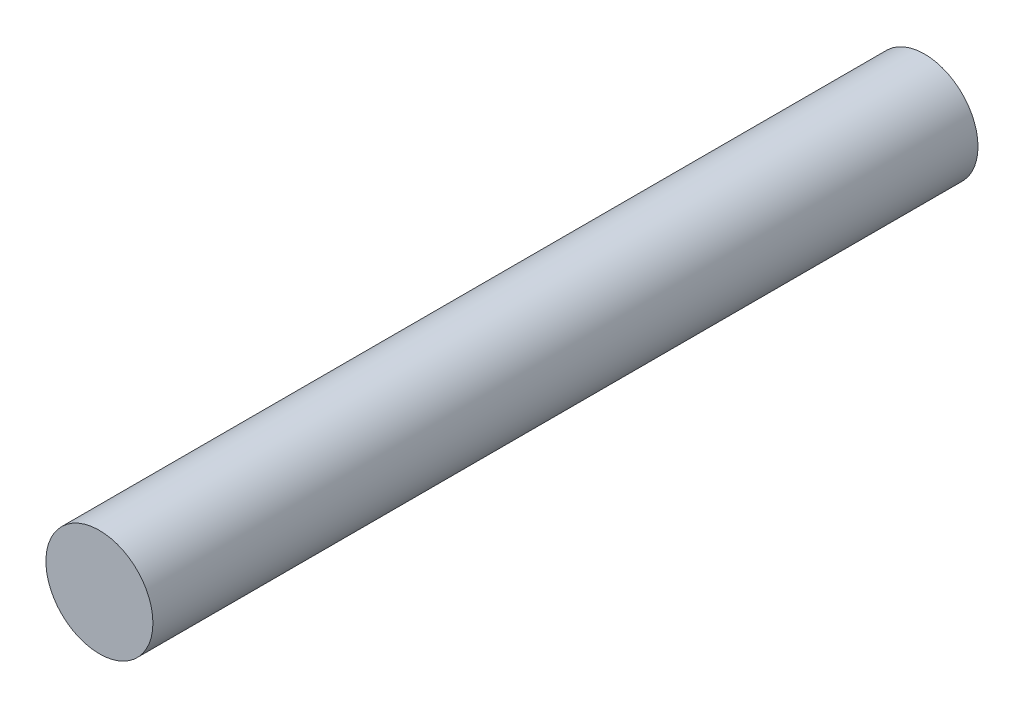
ISO-10303-21;
HEADER;
FILE_DESCRIPTION(('STEP AP214'),'2;1');
FILE_NAME('part.step','',(''),(''),'','','');
FILE_SCHEMA(('AUTOMOTIVE_DESIGN { 1 0 10303 214 1 1 1 1 }'));
ENDSEC;
DATA;
#1=APPLICATION_CONTEXT('core data for automotive mechanical design processes');
#2=APPLICATION_PROTOCOL_DEFINITION('international standard','automotive_design',2000,#1);
#3=PRODUCT_CONTEXT('',#1,'mechanical');
#4=PRODUCT('Part','Part','',(#3));
#5=PRODUCT_RELATED_PRODUCT_CATEGORY('part','',(#4));
#6=PRODUCT_DEFINITION_FORMATION('','',#4);
#7=PRODUCT_DEFINITION_CONTEXT('part definition',#1,'design');
#8=PRODUCT_DEFINITION('design','',#6,#7);
#9=PRODUCT_DEFINITION_SHAPE('','',#8);
#10=(LENGTH_UNIT() NAMED_UNIT(*) SI_UNIT(.MILLI.,.METRE.));
#11=(NAMED_UNIT(*) PLANE_ANGLE_UNIT() SI_UNIT($,.RADIAN.));
#12=(NAMED_UNIT(*) SI_UNIT($,.STERADIAN.) SOLID_ANGLE_UNIT());
#13=UNCERTAINTY_MEASURE_WITH_UNIT(LENGTH_MEASURE(1.E-05),#10,'distance_accuracy_value','');
#14=(GEOMETRIC_REPRESENTATION_CONTEXT(3) GLOBAL_UNCERTAINTY_ASSIGNED_CONTEXT((#13)) GLOBAL_UNIT_ASSIGNED_CONTEXT((#10,
#11,#12)) REPRESENTATION_CONTEXT('',''));
#15=CARTESIAN_POINT('',(0.,0.,0.));
#16=DIRECTION('',(0.,0.,1.));
#17=DIRECTION('',(1.,0.,0.));
#18=AXIS2_PLACEMENT_3D('',#15,#16,#17);
#19=CARTESIAN_POINT('',(0.,0.,43.18));
#20=DIRECTION('',(0.,0.,-1.));
#21=DIRECTION('',(-1.,0.,0.));
#22=AXIS2_PLACEMENT_3D('',#19,#20,#21);
#23=CYLINDRICAL_SURFACE('',#22,2.8);
#24=CARTESIAN_POINT('',(0.,0.,43.18));
#25=DIRECTION('',(0.,0.,1.));
#26=DIRECTION('',(1.,0.,0.));
#27=AXIS2_PLACEMENT_3D('',#24,#25,#26);
#28=CIRCLE('',#27,2.8);
#29=CARTESIAN_POINT('',(2.8,0.,43.18));
#30=VERTEX_POINT('',#29);
#31=EDGE_CURVE('E10',#30,#30,#28,.T.);
#32=ORIENTED_EDGE('',*,*,#31,.F.);
#33=EDGE_LOOP('',(#32));
#34=FACE_BOUND('',#33,.T.);
#35=CARTESIAN_POINT('',(0.,0.,0.));
#36=DIRECTION('',(0.,0.,1.));
#37=DIRECTION('',(1.,0.,0.));
#38=AXIS2_PLACEMENT_3D('',#35,#36,#37);
#39=CIRCLE('',#38,2.8);
#40=CARTESIAN_POINT('',(2.8,0.,0.));
#41=VERTEX_POINT('',#40);
#42=EDGE_CURVE('E34',#41,#41,#39,.T.);
#43=ORIENTED_EDGE('',*,*,#42,.T.);
#44=EDGE_LOOP('',(#43));
#45=FACE_BOUND('',#44,.T.);
#46=ADVANCED_FACE('F31',(#34,#45),#23,.T.);
#47=CARTESIAN_POINT('',(0.,0.,43.18));
#48=DIRECTION('',(0.,0.,1.));
#49=DIRECTION('',(1.,0.,0.));
#50=AXIS2_PLACEMENT_3D('',#47,#48,#49);
#51=PLANE('',#50);
#52=ORIENTED_EDGE('',*,*,#31,.T.);
#53=EDGE_LOOP('',(#52));
#54=FACE_BOUND('',#53,.T.);
#55=ADVANCED_FACE('F46',(#54),#51,.T.);
#56=CARTESIAN_POINT('',(0.,0.,0.));
#57=DIRECTION('',(0.,0.,1.));
#58=DIRECTION('',(1.,0.,0.));
#59=AXIS2_PLACEMENT_3D('',#56,#57,#58);
#60=PLANE('',#59);
#61=ORIENTED_EDGE('',*,*,#42,.F.);
#62=EDGE_LOOP('',(#61));
#63=FACE_BOUND('',#62,.T.);
#64=ADVANCED_FACE('F44',(#63),#60,.F.);
#65=CLOSED_SHELL('',(#46,#55,#64));
#66=MANIFOLD_SOLID_BREP('B2',#65);
#67=ADVANCED_BREP_SHAPE_REPRESENTATION('',(#18,#66),#14);
#68=SHAPE_DEFINITION_REPRESENTATION(#9,#67);
ENDSEC;
END-ISO-10303-21;
